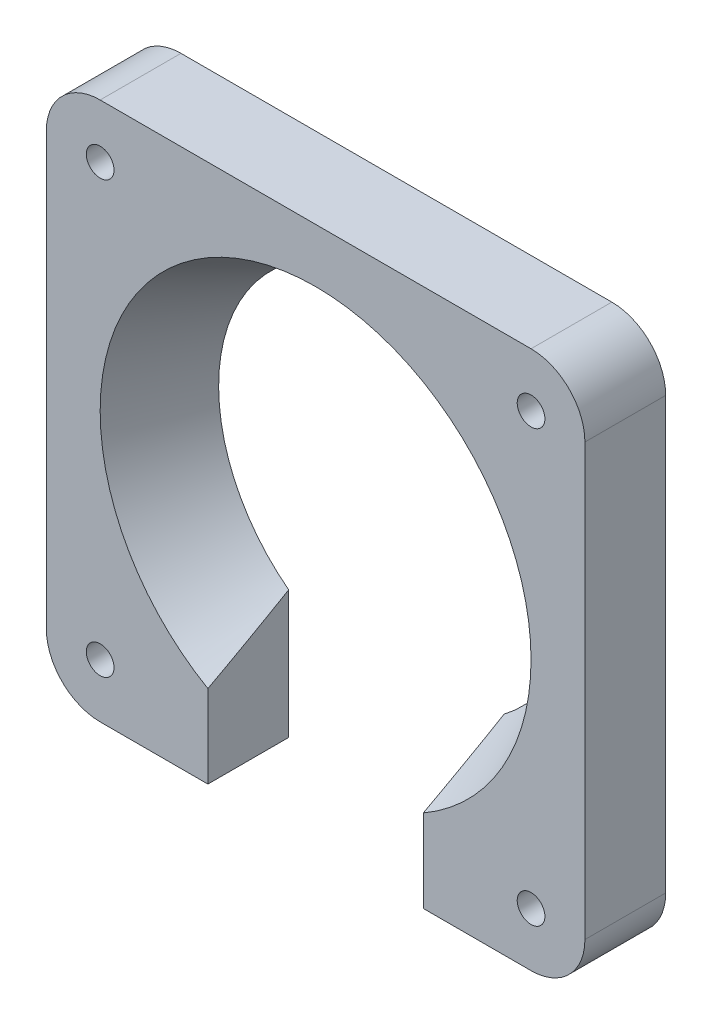
ISO-10303-21;
HEADER;
FILE_DESCRIPTION(('STEP AP214'),'2;1');
FILE_NAME('part.step','',(''),(''),'','','');
FILE_SCHEMA(('AUTOMOTIVE_DESIGN { 1 0 10303 214 1 1 1 1 }'));
ENDSEC;
DATA;
#1=APPLICATION_CONTEXT('core data for automotive mechanical design processes');
#2=APPLICATION_PROTOCOL_DEFINITION('international standard','automotive_design',2000,#1);
#3=PRODUCT_CONTEXT('',#1,'mechanical');
#4=PRODUCT('Part','Part','',(#3));
#5=PRODUCT_RELATED_PRODUCT_CATEGORY('part','',(#4));
#6=PRODUCT_DEFINITION_FORMATION('','',#4);
#7=PRODUCT_DEFINITION_CONTEXT('part definition',#1,'design');
#8=PRODUCT_DEFINITION('design','',#6,#7);
#9=PRODUCT_DEFINITION_SHAPE('','',#8);
#10=(LENGTH_UNIT() NAMED_UNIT(*) SI_UNIT(.MILLI.,.METRE.));
#11=(NAMED_UNIT(*) PLANE_ANGLE_UNIT() SI_UNIT($,.RADIAN.));
#12=(NAMED_UNIT(*) SI_UNIT($,.STERADIAN.) SOLID_ANGLE_UNIT());
#13=UNCERTAINTY_MEASURE_WITH_UNIT(LENGTH_MEASURE(1.E-05),#10,'distance_accuracy_value','');
#14=(GEOMETRIC_REPRESENTATION_CONTEXT(3) GLOBAL_UNCERTAINTY_ASSIGNED_CONTEXT((#13)) GLOBAL_UNIT_ASSIGNED_CONTEXT((#10,
#11,#12)) REPRESENTATION_CONTEXT('',''));
#15=CARTESIAN_POINT('',(0.,0.,0.));
#16=DIRECTION('',(0.,0.,1.));
#17=DIRECTION('',(1.,0.,0.));
#18=AXIS2_PLACEMENT_3D('',#15,#16,#17);
#19=CARTESIAN_POINT('',(-27.3498641304348,-38.0482336956522,9.525));
#20=DIRECTION('',(0.,1.,0.));
#21=DIRECTION('',(0.,0.,1.));
#22=AXIS2_PLACEMENT_3D('',#19,#20,#21);
#23=PLANE('',#22);
#24=DIRECTION('',(1.,0.,0.));
#25=VECTOR('',#24,1.);
#26=CARTESIAN_POINT('',(-27.3498641304348,-38.0482336956522,9.525));
#27=LINE('',#26,#25);
#28=CARTESIAN_POINT('',(-20.9998641304348,-38.0482336956522,9.525));
#29=VERTEX_POINT('',#28);
#30=CARTESIAN_POINT('',(-8.29986413043476,-38.0482336956522,9.525));
#31=VERTEX_POINT('',#30);
#32=EDGE_CURVE('E122',#29,#31,#27,.T.);
#33=ORIENTED_EDGE('',*,*,#32,.F.);
#34=DIRECTION('',(0.,0.,-1.));
#35=VECTOR('',#34,1.);
#36=CARTESIAN_POINT('',(-20.9998641304348,-38.0482336956522,9.525));
#37=LINE('',#36,#35);
#38=CARTESIAN_POINT('',(-20.9998641304348,-38.0482336956522,0.));
#39=VERTEX_POINT('',#38);
#40=EDGE_CURVE('E374',#29,#39,#37,.T.);
#41=ORIENTED_EDGE('',*,*,#40,.T.);
#42=DIRECTION('',(1.,0.,0.));
#43=VECTOR('',#42,1.);
#44=CARTESIAN_POINT('',(-27.3498641304348,-38.0482336956522,0.));
#45=LINE('',#44,#43);
#46=CARTESIAN_POINT('',(-8.29986413043476,-38.0482336956522,0.));
#47=VERTEX_POINT('',#46);
#48=EDGE_CURVE('E149',#39,#47,#45,.T.);
#49=ORIENTED_EDGE('',*,*,#48,.T.);
#50=DIRECTION('',(0.,0.,1.));
#51=VECTOR('',#50,1.);
#52=CARTESIAN_POINT('',(-8.29986413043476,-38.0482336956522,-38.390523041433));
#53=LINE('',#52,#51);
#54=EDGE_CURVE('E141',#47,#31,#53,.T.);
#55=ORIENTED_EDGE('',*,*,#54,.T.);
#56=EDGE_LOOP('',(#33,#41,#49,#55));
#57=FACE_BOUND('',#56,.T.);
#58=ADVANCED_FACE('F33',(#57),#23,.F.);
#59=CARTESIAN_POINT('',(-27.3498641304348,25.4517663043478,9.525));
#60=DIRECTION('',(1.,0.,0.));
#61=DIRECTION('',(0.,1.,0.));
#62=AXIS2_PLACEMENT_3D('',#59,#60,#61);
#63=PLANE('',#62);
#64=DIRECTION('',(0.,-1.,0.));
#65=VECTOR('',#64,1.);
#66=CARTESIAN_POINT('',(-27.3498641304348,25.4517663043478,9.525));
#67=LINE('',#66,#65);
#68=CARTESIAN_POINT('',(-27.3498641304348,19.1017663043478,9.525));
#69=VERTEX_POINT('',#68);
#70=CARTESIAN_POINT('',(-27.3498641304348,-31.6982336956522,9.525));
#71=VERTEX_POINT('',#70);
#72=EDGE_CURVE('E160',#69,#71,#67,.T.);
#73=ORIENTED_EDGE('',*,*,#72,.F.);
#74=DIRECTION('',(0.,0.,-1.));
#75=VECTOR('',#74,1.);
#76=CARTESIAN_POINT('',(-27.3498641304348,19.1017663043478,9.525));
#77=LINE('',#76,#75);
#78=CARTESIAN_POINT('',(-27.3498641304348,19.1017663043478,0.));
#79=VERTEX_POINT('',#78);
#80=EDGE_CURVE('E399',#69,#79,#77,.T.);
#81=ORIENTED_EDGE('',*,*,#80,.T.);
#82=DIRECTION('',(0.,-1.,0.));
#83=VECTOR('',#82,1.);
#84=CARTESIAN_POINT('',(-27.3498641304348,25.4517663043478,0.));
#85=LINE('',#84,#83);
#86=CARTESIAN_POINT('',(-27.3498641304348,-31.6982336956522,0.));
#87=VERTEX_POINT('',#86);
#88=EDGE_CURVE('E168',#79,#87,#85,.T.);
#89=ORIENTED_EDGE('',*,*,#88,.T.);
#90=DIRECTION('',(0.,0.,-1.));
#91=VECTOR('',#90,1.);
#92=CARTESIAN_POINT('',(-27.3498641304348,-31.6982336956522,9.525));
#93=LINE('',#92,#91);
#94=EDGE_CURVE('E365',#87,#71,#93,.F.);
#95=ORIENTED_EDGE('',*,*,#94,.T.);
#96=EDGE_LOOP('',(#73,#81,#89,#95));
#97=FACE_BOUND('',#96,.T.);
#98=ADVANCED_FACE('F219',(#97),#63,.F.);
#99=CARTESIAN_POINT('',(17.1001358695652,-38.0482336956522,0.));
#100=VERTEX_POINT('',#99);
#101=CARTESIAN_POINT('',(29.8001358695652,-38.0482336956522,0.));
#102=VERTEX_POINT('',#101);
#103=EDGE_CURVE('E171',#100,#102,#45,.T.);
#104=ORIENTED_EDGE('',*,*,#103,.T.);
#105=DIRECTION('',(0.,0.,-1.));
#106=VECTOR('',#105,1.);
#107=CARTESIAN_POINT('',(29.8001358695652,-38.0482336956522,9.525));
#108=LINE('',#107,#106);
#109=CARTESIAN_POINT('',(29.8001358695652,-38.0482336956522,9.525));
#110=VERTEX_POINT('',#109);
#111=EDGE_CURVE('E41',#102,#110,#108,.F.);
#112=ORIENTED_EDGE('',*,*,#111,.T.);
#113=CARTESIAN_POINT('',(17.1001358695652,-38.0482336956522,9.525));
#114=VERTEX_POINT('',#113);
#115=EDGE_CURVE('E136',#114,#110,#27,.T.);
#116=ORIENTED_EDGE('',*,*,#115,.F.);
#117=DIRECTION('',(0.,0.,1.));
#118=VECTOR('',#117,1.);
#119=CARTESIAN_POINT('',(17.1001358695652,-38.0482336956522,-38.390523041433));
#120=LINE('',#119,#118);
#121=EDGE_CURVE('E150',#100,#114,#120,.T.);
#122=ORIENTED_EDGE('',*,*,#121,.F.);
#123=EDGE_LOOP('',(#104,#112,#116,#122));
#124=FACE_BOUND('',#123,.T.);
#125=ADVANCED_FACE('F215',(#124),#23,.F.);
#126=CARTESIAN_POINT('',(36.1501358695652,25.4517663043478,9.525));
#127=DIRECTION('',(-1.,0.,0.));
#128=DIRECTION('',(0.,-1.,0.));
#129=AXIS2_PLACEMENT_3D('',#126,#127,#128);
#130=PLANE('',#129);
#131=DIRECTION('',(0.,1.,0.));
#132=VECTOR('',#131,1.);
#133=CARTESIAN_POINT('',(36.1501358695652,25.4517663043478,9.525));
#134=LINE('',#133,#132);
#135=CARTESIAN_POINT('',(36.1501358695652,-31.6982336956522,9.525));
#136=VERTEX_POINT('',#135);
#137=CARTESIAN_POINT('',(36.1501358695652,19.1017663043478,9.525));
#138=VERTEX_POINT('',#137);
#139=EDGE_CURVE('E135',#136,#138,#134,.T.);
#140=ORIENTED_EDGE('',*,*,#139,.F.);
#141=DIRECTION('',(0.,0.,-1.));
#142=VECTOR('',#141,1.);
#143=CARTESIAN_POINT('',(36.1501358695652,-31.6982336956522,9.525));
#144=LINE('',#143,#142);
#145=CARTESIAN_POINT('',(36.1501358695652,-31.6982336956522,0.));
#146=VERTEX_POINT('',#145);
#147=EDGE_CURVE('E373',#136,#146,#144,.T.);
#148=ORIENTED_EDGE('',*,*,#147,.T.);
#149=DIRECTION('',(0.,1.,0.));
#150=VECTOR('',#149,1.);
#151=CARTESIAN_POINT('',(36.1501358695652,25.4517663043478,0.));
#152=LINE('',#151,#150);
#153=CARTESIAN_POINT('',(36.1501358695652,19.1017663043478,0.));
#154=VERTEX_POINT('',#153);
#155=EDGE_CURVE('E173',#146,#154,#152,.T.);
#156=ORIENTED_EDGE('',*,*,#155,.T.);
#157=DIRECTION('',(0.,0.,-1.));
#158=VECTOR('',#157,1.);
#159=CARTESIAN_POINT('',(36.1501358695652,19.1017663043478,9.525));
#160=LINE('',#159,#158);
#161=EDGE_CURVE('E377',#154,#138,#160,.F.);
#162=ORIENTED_EDGE('',*,*,#161,.T.);
#163=EDGE_LOOP('',(#140,#148,#156,#162));
#164=FACE_BOUND('',#163,.T.);
#165=ADVANCED_FACE('F211',(#164),#130,.F.);
#166=CARTESIAN_POINT('',(-27.3498641304348,25.4517663043478,9.525));
#167=DIRECTION('',(0.,-1.,0.));
#168=DIRECTION('',(0.,0.,-1.));
#169=AXIS2_PLACEMENT_3D('',#166,#167,#168);
#170=PLANE('',#169);
#171=DIRECTION('',(-1.,0.,0.));
#172=VECTOR('',#171,1.);
#173=CARTESIAN_POINT('',(-27.3498641304348,25.4517663043478,0.));
#174=LINE('',#173,#172);
#175=CARTESIAN_POINT('',(29.8001358695652,25.4517663043478,0.));
#176=VERTEX_POINT('',#175);
#177=CARTESIAN_POINT('',(-20.9998641304348,25.4517663043478,0.));
#178=VERTEX_POINT('',#177);
#179=EDGE_CURVE('E161',#176,#178,#174,.T.);
#180=ORIENTED_EDGE('',*,*,#179,.T.);
#181=DIRECTION('',(0.,0.,-1.));
#182=VECTOR('',#181,1.);
#183=CARTESIAN_POINT('',(-20.9998641304348,25.4517663043478,9.525));
#184=LINE('',#183,#182);
#185=CARTESIAN_POINT('',(-20.9998641304348,25.4517663043478,9.525));
#186=VERTEX_POINT('',#185);
#187=EDGE_CURVE('E387',#178,#186,#184,.F.);
#188=ORIENTED_EDGE('',*,*,#187,.T.);
#189=DIRECTION('',(-1.,0.,0.));
#190=VECTOR('',#189,1.);
#191=CARTESIAN_POINT('',(-27.3498641304348,25.4517663043478,9.525));
#192=LINE('',#191,#190);
#193=CARTESIAN_POINT('',(29.8001358695652,25.4517663043478,9.525));
#194=VERTEX_POINT('',#193);
#195=EDGE_CURVE('E164',#194,#186,#192,.T.);
#196=ORIENTED_EDGE('',*,*,#195,.F.);
#197=DIRECTION('',(0.,0.,-1.));
#198=VECTOR('',#197,1.);
#199=CARTESIAN_POINT('',(29.8001358695652,25.4517663043478,9.525));
#200=LINE('',#199,#198);
#201=EDGE_CURVE('E389',#194,#176,#200,.T.);
#202=ORIENTED_EDGE('',*,*,#201,.T.);
#203=EDGE_LOOP('',(#180,#188,#196,#202));
#204=FACE_BOUND('',#203,.T.);
#205=ADVANCED_FACE('F204',(#204),#170,.F.);
#206=CARTESIAN_POINT('',(0.,0.,9.525));
#207=DIRECTION('',(0.,0.,1.));
#208=DIRECTION('',(1.,0.,0.));
#209=AXIS2_PLACEMENT_3D('',#206,#207,#208);
#210=PLANE('',#209);
#211=CARTESIAN_POINT('',(-20.9998641304342,-31.6982336956522,9.525));
#212=DIRECTION('',(0.,0.,1.));
#213=DIRECTION('',(1.,0.,0.));
#214=AXIS2_PLACEMENT_3D('',#211,#212,#213);
#215=CIRCLE('',#214,1.63195);
#216=CARTESIAN_POINT('',(-19.3679141304342,-31.6982336956522,9.525));
#217=VERTEX_POINT('',#216);
#218=EDGE_CURVE('E342',#217,#217,#215,.T.);
#219=ORIENTED_EDGE('',*,*,#218,.F.);
#220=EDGE_LOOP('',(#219));
#221=FACE_BOUND('',#220,.T.);
#222=CARTESIAN_POINT('',(29.8001358695658,-31.6982336956522,9.525));
#223=DIRECTION('',(0.,0.,1.));
#224=DIRECTION('',(1.,0.,0.));
#225=AXIS2_PLACEMENT_3D('',#222,#223,#224);
#226=CIRCLE('',#225,1.63195);
#227=CARTESIAN_POINT('',(31.4320858695658,-31.6982336956522,9.525));
#228=VERTEX_POINT('',#227);
#229=EDGE_CURVE('E344',#228,#228,#226,.T.);
#230=ORIENTED_EDGE('',*,*,#229,.F.);
#231=EDGE_LOOP('',(#230));
#232=FACE_BOUND('',#231,.T.);
#233=CARTESIAN_POINT('',(29.8001358695652,19.1017663043478,9.525));
#234=DIRECTION('',(0.,0.,1.));
#235=DIRECTION('',(1.,0.,0.));
#236=AXIS2_PLACEMENT_3D('',#233,#234,#235);
#237=CIRCLE('',#236,1.63195);
#238=CARTESIAN_POINT('',(31.4320858695652,19.1017663043478,9.525));
#239=VERTEX_POINT('',#238);
#240=EDGE_CURVE('E352',#239,#239,#237,.T.);
#241=ORIENTED_EDGE('',*,*,#240,.F.);
#242=EDGE_LOOP('',(#241));
#243=FACE_BOUND('',#242,.T.);
#244=CARTESIAN_POINT('',(-20.9998641304348,19.1017663043478,9.525));
#245=DIRECTION('',(0.,0.,1.));
#246=DIRECTION('',(1.,0.,0.));
#247=AXIS2_PLACEMENT_3D('',#244,#245,#246);
#248=CIRCLE('',#247,1.63195);
#249=CARTESIAN_POINT('',(-19.3679141304348,19.1017663043478,9.525));
#250=VERTEX_POINT('',#249);
#251=EDGE_CURVE('E358',#250,#250,#248,.T.);
#252=ORIENTED_EDGE('',*,*,#251,.F.);
#253=EDGE_LOOP('',(#252));
#254=FACE_BOUND('',#253,.T.);
#255=ORIENTED_EDGE('',*,*,#115,.T.);
#256=CARTESIAN_POINT('',(29.8001358695652,-31.6982336956522,9.525));
#257=DIRECTION('',(0.,0.,1.));
#258=DIRECTION('',(1.,0.,0.));
#259=AXIS2_PLACEMENT_3D('',#256,#257,#258);
#260=CIRCLE('',#259,6.35);
#261=EDGE_CURVE('E11',#110,#136,#260,.T.);
#262=ORIENTED_EDGE('',*,*,#261,.T.);
#263=ORIENTED_EDGE('',*,*,#139,.T.);
#264=CARTESIAN_POINT('',(29.8001358695652,19.1017663043478,9.525));
#265=DIRECTION('',(0.,0.,1.));
#266=DIRECTION('',(1.,0.,0.));
#267=AXIS2_PLACEMENT_3D('',#264,#265,#266);
#268=CIRCLE('',#267,6.35);
#269=EDGE_CURVE('E384',#138,#194,#268,.T.);
#270=ORIENTED_EDGE('',*,*,#269,.T.);
#271=ORIENTED_EDGE('',*,*,#195,.T.);
#272=CARTESIAN_POINT('',(-20.9998641304348,19.1017663043478,9.525));
#273=DIRECTION('',(0.,0.,1.));
#274=DIRECTION('',(1.,0.,0.));
#275=AXIS2_PLACEMENT_3D('',#272,#273,#274);
#276=CIRCLE('',#275,6.35);
#277=EDGE_CURVE('E382',#186,#69,#276,.T.);
#278=ORIENTED_EDGE('',*,*,#277,.T.);
#279=ORIENTED_EDGE('',*,*,#72,.T.);
#280=CARTESIAN_POINT('',(-20.9998641304348,-31.6982336956522,9.525));
#281=DIRECTION('',(0.,0.,1.));
#282=DIRECTION('',(1.,0.,0.));
#283=AXIS2_PLACEMENT_3D('',#280,#281,#282);
#284=CIRCLE('',#283,6.35);
#285=EDGE_CURVE('E130',#71,#29,#284,.T.);
#286=ORIENTED_EDGE('',*,*,#285,.T.);
#287=ORIENTED_EDGE('',*,*,#32,.T.);
#288=DIRECTION('',(0.,-1.,0.));
#289=VECTOR('',#288,1.);
#290=CARTESIAN_POINT('',(-8.29986413043476,-38.0482336956522,9.525));
#291=LINE('',#290,#289);
#292=CARTESIAN_POINT('',(-8.29986413043476,-28.2952789517769,9.525));
#293=VERTEX_POINT('',#292);
#294=EDGE_CURVE('E126',#293,#31,#291,.T.);
#295=ORIENTED_EDGE('',*,*,#294,.F.);
#296=CARTESIAN_POINT('',(4.40013586956524,-6.29823369565218,9.525));
#297=DIRECTION('',(0.,0.,1.));
#298=DIRECTION('',(1.,0.,0.));
#299=AXIS2_PLACEMENT_3D('',#296,#297,#298);
#300=CIRCLE('',#299,25.4);
#301=CARTESIAN_POINT('',(17.1001358695652,-28.2952789517769,9.525));
#302=VERTEX_POINT('',#301);
#303=EDGE_CURVE('E156',#302,#293,#300,.T.);
#304=ORIENTED_EDGE('',*,*,#303,.F.);
#305=DIRECTION('',(0.,1.,0.));
#306=VECTOR('',#305,1.);
#307=CARTESIAN_POINT('',(17.1001358695652,-38.0482336956522,9.525));
#308=LINE('',#307,#306);
#309=EDGE_CURVE('E145',#114,#302,#308,.T.);
#310=ORIENTED_EDGE('',*,*,#309,.F.);
#311=EDGE_LOOP('',(#255,#262,#263,#270,#271,#278,#279,#286,#287,#295,#304,#310));
#312=FACE_BOUND('',#311,.T.);
#313=ADVANCED_FACE('F124',(#221,#232,#243,#254,#312),#210,.T.);
#314=CARTESIAN_POINT('',(0.,0.,0.));
#315=DIRECTION('',(0.,0.,1.));
#316=DIRECTION('',(1.,0.,0.));
#317=AXIS2_PLACEMENT_3D('',#314,#315,#316);
#318=PLANE('',#317);
#319=CARTESIAN_POINT('',(-20.9998641304342,-31.6982336956522,0.));
#320=DIRECTION('',(0.,0.,1.));
#321=DIRECTION('',(1.,0.,0.));
#322=AXIS2_PLACEMENT_3D('',#319,#320,#321);
#323=CIRCLE('',#322,1.63195);
#324=CARTESIAN_POINT('',(-19.3679141304342,-31.6982336956522,0.));
#325=VERTEX_POINT('',#324);
#326=EDGE_CURVE('E339',#325,#325,#323,.F.);
#327=ORIENTED_EDGE('',*,*,#326,.F.);
#328=EDGE_LOOP('',(#327));
#329=FACE_BOUND('',#328,.T.);
#330=CARTESIAN_POINT('',(29.8001358695658,-31.6982336956522,0.));
#331=DIRECTION('',(0.,0.,1.));
#332=DIRECTION('',(1.,0.,0.));
#333=AXIS2_PLACEMENT_3D('',#330,#331,#332);
#334=CIRCLE('',#333,1.63195);
#335=CARTESIAN_POINT('',(31.4320858695658,-31.6982336956522,0.));
#336=VERTEX_POINT('',#335);
#337=EDGE_CURVE('E349',#336,#336,#334,.F.);
#338=ORIENTED_EDGE('',*,*,#337,.F.);
#339=EDGE_LOOP('',(#338));
#340=FACE_BOUND('',#339,.T.);
#341=CARTESIAN_POINT('',(29.8001358695652,19.1017663043478,0.));
#342=DIRECTION('',(0.,0.,1.));
#343=DIRECTION('',(1.,0.,0.));
#344=AXIS2_PLACEMENT_3D('',#341,#342,#343);
#345=CIRCLE('',#344,1.63195);
#346=CARTESIAN_POINT('',(31.4320858695652,19.1017663043478,0.));
#347=VERTEX_POINT('',#346);
#348=EDGE_CURVE('E355',#347,#347,#345,.F.);
#349=ORIENTED_EDGE('',*,*,#348,.F.);
#350=EDGE_LOOP('',(#349));
#351=FACE_BOUND('',#350,.T.);
#352=CARTESIAN_POINT('',(-20.9998641304348,19.1017663043478,0.));
#353=DIRECTION('',(0.,0.,1.));
#354=DIRECTION('',(1.,0.,0.));
#355=AXIS2_PLACEMENT_3D('',#352,#353,#354);
#356=CIRCLE('',#355,1.63195);
#357=CARTESIAN_POINT('',(-19.3679141304348,19.1017663043478,0.));
#358=VERTEX_POINT('',#357);
#359=EDGE_CURVE('E146',#358,#358,#356,.F.);
#360=ORIENTED_EDGE('',*,*,#359,.F.);
#361=EDGE_LOOP('',(#360));
#362=FACE_BOUND('',#361,.T.);
#363=ORIENTED_EDGE('',*,*,#155,.F.);
#364=CARTESIAN_POINT('',(29.8001358695652,-31.6982336956522,0.));
#365=DIRECTION('',(0.,0.,1.));
#366=DIRECTION('',(1.,0.,0.));
#367=AXIS2_PLACEMENT_3D('',#364,#365,#366);
#368=CIRCLE('',#367,6.35);
#369=EDGE_CURVE('E55',#146,#102,#368,.F.);
#370=ORIENTED_EDGE('',*,*,#369,.T.);
#371=ORIENTED_EDGE('',*,*,#103,.F.);
#372=DIRECTION('',(0.,-1.,0.));
#373=VECTOR('',#372,1.);
#374=CARTESIAN_POINT('',(17.1001358695652,-38.0482336956522,0.));
#375=LINE('',#374,#373);
#376=CARTESIAN_POINT('',(17.1001358695652,-22.9705265880053,0.));
#377=VERTEX_POINT('',#376);
#378=EDGE_CURVE('E152',#377,#100,#375,.T.);
#379=ORIENTED_EDGE('',*,*,#378,.F.);
#380=CARTESIAN_POINT('',(4.40013586956524,-6.29823369565218,0.));
#381=DIRECTION('',(0.,0.,1.));
#382=DIRECTION('',(1.,0.,0.));
#383=AXIS2_PLACEMENT_3D('',#380,#381,#382);
#384=CIRCLE('',#383,20.9584195560736);
#385=CARTESIAN_POINT('',(-8.29986413043476,-22.9705265880053,0.));
#386=VERTEX_POINT('',#385);
#387=EDGE_CURVE('E158',#377,#386,#384,.T.);
#388=ORIENTED_EDGE('',*,*,#387,.T.);
#389=DIRECTION('',(0.,1.,0.));
#390=VECTOR('',#389,1.);
#391=CARTESIAN_POINT('',(-8.29986413043476,-38.0482336956522,0.));
#392=LINE('',#391,#390);
#393=EDGE_CURVE('E159',#47,#386,#392,.T.);
#394=ORIENTED_EDGE('',*,*,#393,.F.);
#395=ORIENTED_EDGE('',*,*,#48,.F.);
#396=CARTESIAN_POINT('',(-20.9998641304348,-31.6982336956522,0.));
#397=DIRECTION('',(0.,0.,1.));
#398=DIRECTION('',(1.,0.,0.));
#399=AXIS2_PLACEMENT_3D('',#396,#397,#398);
#400=CIRCLE('',#399,6.35);
#401=EDGE_CURVE('E397',#39,#87,#400,.F.);
#402=ORIENTED_EDGE('',*,*,#401,.T.);
#403=ORIENTED_EDGE('',*,*,#88,.F.);
#404=CARTESIAN_POINT('',(-20.9998641304348,19.1017663043478,0.));
#405=DIRECTION('',(0.,0.,1.));
#406=DIRECTION('',(1.,0.,0.));
#407=AXIS2_PLACEMENT_3D('',#404,#405,#406);
#408=CIRCLE('',#407,6.35);
#409=EDGE_CURVE('E392',#79,#178,#408,.F.);
#410=ORIENTED_EDGE('',*,*,#409,.T.);
#411=ORIENTED_EDGE('',*,*,#179,.F.);
#412=CARTESIAN_POINT('',(29.8001358695652,19.1017663043478,0.));
#413=DIRECTION('',(0.,0.,1.));
#414=DIRECTION('',(1.,0.,0.));
#415=AXIS2_PLACEMENT_3D('',#412,#413,#414);
#416=CIRCLE('',#415,6.35);
#417=EDGE_CURVE('E394',#176,#154,#416,.F.);
#418=ORIENTED_EDGE('',*,*,#417,.T.);
#419=EDGE_LOOP('',(#363,#370,#371,#379,#388,#394,#395,#402,#403,#410,#411,#418));
#420=FACE_BOUND('',#419,.T.);
#421=ADVANCED_FACE('F198',(#329,#340,#351,#362,#420),#318,.F.);
#422=CARTESIAN_POINT('',(4.40013586956524,-6.29823369565218,9.525));
#423=DIRECTION('',(0.,0.,1.));
#424=DIRECTION('',(1.,0.,0.));
#425=AXIS2_PLACEMENT_3D('',#422,#423,#424);
#426=CONICAL_SURFACE('',#425,25.4,0.436332312998583);
#427=ORIENTED_EDGE('',*,*,#303,.T.);
#428=CARTESIAN_POINT('',(-8.29986413043476,-43.223035633129,38.7928101524576));
#429=CARTESIAN_POINT('',(-8.29986413043476,-42.5873699572847,37.5037876512553));
#430=CARTESIAN_POINT('',(-8.29986413043476,-41.9503459683332,36.2154331346811));
#431=CARTESIAN_POINT('',(-8.29986413043476,-40.673023977189,33.640339422663));
#432=CARTESIAN_POINT('',(-8.29986413043476,-40.0327259566904,32.3536002363008));
#433=CARTESIAN_POINT('',(-8.29986413043476,-38.7481937130702,29.7818069234031));
#434=CARTESIAN_POINT('',(-8.29986413043476,-38.1039588235012,28.4967531295616));
#435=CARTESIAN_POINT('',(-8.29986413043476,-36.8109321479781,25.9289422349335));
#436=CARTESIAN_POINT('',(-8.29986413043476,-36.1621403711872,24.6461851295351));
#437=CARTESIAN_POINT('',(-8.29986413043476,-34.8524103967518,22.0703520935095));
#438=CARTESIAN_POINT('',(-8.29986413043476,-34.191415836118,20.777304802498));
#439=CARTESIAN_POINT('',(-8.29986413043476,-32.8625911584359,18.1947276575962));
#440=CARTESIAN_POINT('',(-8.29986413043476,-32.194761057699,16.9051977953218));
#441=CARTESIAN_POINT('',(-8.29986413043476,-30.8506551484377,14.330652020218));
#442=CARTESIAN_POINT('',(-8.29986413043476,-30.1743799025163,13.0456358139263));
#443=CARTESIAN_POINT('',(-8.29986413043476,-28.8111112466367,10.481303564155));
#444=CARTESIAN_POINT('',(-8.29986413043476,-28.1241179478911,9.2019874617069));
#445=CARTESIAN_POINT('',(-8.29986413043476,-27.0841166303343,7.29038808813477));
#446=CARTESIAN_POINT('',(-8.29986413043476,-26.7363350028036,6.65526060998588));
#447=CARTESIAN_POINT('',(-8.29986413043476,-26.0367782637432,5.38720925652358));
#448=CARTESIAN_POINT('',(-8.29986413043476,-25.6850031645022,4.75428537443714));
#449=CARTESIAN_POINT('',(-8.29986413043476,-24.9768173781704,3.49099675293552));
#450=CARTESIAN_POINT('',(-8.29986413043476,-24.6204064831427,2.8606321299907));
#451=CARTESIAN_POINT('',(-8.29986413043476,-23.9021884825069,1.60298350643198));
#452=CARTESIAN_POINT('',(-8.29986413043476,-23.5403813920478,0.975699497176388));
#453=CARTESIAN_POINT('',(-8.29986413043476,-22.8117648211256,-0.272823572855804));
#454=CARTESIAN_POINT('',(-8.29986413043476,-22.4449790646776,-0.894076459490905));
#455=CARTESIAN_POINT('',(-8.29986413043476,-21.7038813954196,-2.13207412212091));
#456=CARTESIAN_POINT('',(-8.29986413043476,-21.3295695733027,-2.7488189523183));
#457=CARTESIAN_POINT('',(-8.29986413043476,-20.5718384729146,-3.97674005353686));
#458=CARTESIAN_POINT('',(-8.29986413043476,-20.1884187943528,-4.58791607816947));
#459=CARTESIAN_POINT('',(-8.29986413043476,-19.41045408442,-5.80312680308748));
#460=CARTESIAN_POINT('',(-8.29986413043476,-19.0159094982812,-6.40716178779655));
#461=CARTESIAN_POINT('',(-8.29986413043476,-18.2117289980107,-7.60779556333008));
#462=CARTESIAN_POINT('',(-8.29986413043476,-17.8020512569043,-8.20436651888663));
#463=CARTESIAN_POINT('',(-8.29986413043476,-17.1742644181978,-9.08964355194574));
#464=CARTESIAN_POINT('',(-8.29986413043476,-16.9628303381482,-9.38308650771256));
#465=CARTESIAN_POINT('',(-8.29986413043476,-16.5348787185661,-9.96623708039018));
#466=CARTESIAN_POINT('',(-8.29986413043476,-16.3183613276268,-10.255944806105));
#467=CARTESIAN_POINT('',(-8.29986413043476,-15.8787812997713,-10.8318694610529));
#468=CARTESIAN_POINT('',(-8.29986413043476,-15.6556994944775,-11.1180717927876));
#469=CARTESIAN_POINT('',(-8.29986413043476,-15.2027936332296,-11.6850531643866));
#470=CARTESIAN_POINT('',(-8.29986413043476,-14.9729702900664,-11.9658327724331));
#471=CARTESIAN_POINT('',(-8.29986413043476,-14.5051564414551,-12.5211585591793));
#472=CARTESIAN_POINT('',(-8.29986413043476,-14.2671557838587,-12.7956962304671));
#473=CARTESIAN_POINT('',(-8.29986413043476,-13.9032052794145,-13.2013498511692));
#474=CARTESIAN_POINT('',(-8.29986413043476,-13.7807067587313,-13.3355666367799));
#475=CARTESIAN_POINT('',(-8.29986413043476,-13.5331925061015,-13.601675706143));
#476=CARTESIAN_POINT('',(-8.29986413043476,-13.4081765898583,-13.7335678183726));
#477=CARTESIAN_POINT('',(-8.29986413043476,-13.2818039329693,-13.8641600903619));
#478=B_SPLINE_CURVE_WITH_KNOTS('',3,(#428,#429,#430,#431,#432,#433,#434,#435,#436,#437,#438,
#439,#440,#441,#442,#443,#444,#445,#446,#447,#448,#449,#450,#451,#452,#453,#454,#455,#456,#457,
#458,#459,#460,#461,#462,#463,#464,#465,#466,#467,#468,#469,#470,#471,#472,#473,#474,#475,#476,
#477),.UNSPECIFIED.,.F.,.F.,(4,2,2,2,2,2,2,2,2,2,2,2,2,2,2,2,2,2,2,2,2,2,2,2,4),(0.,
4.31171232926855,8.62344879280538,12.9359365828072,17.2484157036121,21.6049998254846,
25.9615735538032,30.3178585857216,34.6740984459989,36.8464246916182,39.0187442544247,
41.191161594274,43.3635728366179,45.527872153637,47.6921454053176,49.8565139535127,
52.0207960036929,54.1915885758715,55.276587842217,56.3615554317359,57.4500879303468,
58.5385057490448,59.6283274769779,60.1734411726694,60.718594921872),.UNSPECIFIED.);
#479=EDGE_CURVE('E144',#293,#386,#478,.T.);
#480=ORIENTED_EDGE('',*,*,#479,.T.);
#481=ORIENTED_EDGE('',*,*,#387,.F.);
#482=CARTESIAN_POINT('',(17.1001358695652,-43.223035633129,38.7928101524576));
#483=CARTESIAN_POINT('',(17.1001358695652,-42.5873699572847,37.5037876512553));
#484=CARTESIAN_POINT('',(17.1001358695652,-41.9503459683332,36.2154331346811));
#485=CARTESIAN_POINT('',(17.1001358695652,-40.673023977189,33.640339422663));
#486=CARTESIAN_POINT('',(17.1001358695652,-40.0327259566904,32.3536002363008));
#487=CARTESIAN_POINT('',(17.1001358695652,-38.7481937130702,29.7818069234031));
#488=CARTESIAN_POINT('',(17.1001358695652,-38.1039588235012,28.4967531295616));
#489=CARTESIAN_POINT('',(17.1001358695652,-36.8109321479781,25.9289422349334));
#490=CARTESIAN_POINT('',(17.1001358695652,-36.1621403711872,24.6461851295351));
#491=CARTESIAN_POINT('',(17.1001358695652,-34.8524103967517,22.0703520935095));
#492=CARTESIAN_POINT('',(17.1001358695652,-34.191415836118,20.7773048024979));
#493=CARTESIAN_POINT('',(17.1001358695652,-32.8625911584359,18.1947276575962));
#494=CARTESIAN_POINT('',(17.1001358695652,-32.194761057699,16.9051977953218));
#495=CARTESIAN_POINT('',(17.1001358695652,-30.8506551484377,14.330652020218));
#496=CARTESIAN_POINT('',(17.1001358695652,-30.1743799025162,13.0456358139263));
#497=CARTESIAN_POINT('',(17.1001358695652,-28.8111112466367,10.481303564155));
#498=CARTESIAN_POINT('',(17.1001358695652,-28.1241179478911,9.20198746170689));
#499=CARTESIAN_POINT('',(17.1001358695652,-27.0841166303343,7.29038808813476));
#500=CARTESIAN_POINT('',(17.1001358695652,-26.7363350028036,6.65526060998588));
#501=CARTESIAN_POINT('',(17.1001358695652,-26.0367782637432,5.38720925652358));
#502=CARTESIAN_POINT('',(17.1001358695652,-25.6850031645022,4.75428537443714));
#503=CARTESIAN_POINT('',(17.1001358695652,-24.9768173781705,3.49099675293551));
#504=CARTESIAN_POINT('',(17.1001358695652,-24.6204064831427,2.8606321299907));
#505=CARTESIAN_POINT('',(17.1001358695652,-23.9021884825069,1.60298350643197));
#506=CARTESIAN_POINT('',(17.1001358695652,-23.5403813920478,0.975699497176384));
#507=CARTESIAN_POINT('',(17.1001358695652,-22.8117648211256,-0.27282357285581));
#508=CARTESIAN_POINT('',(17.1001358695652,-22.4449790646776,-0.894076459490912));
#509=CARTESIAN_POINT('',(17.1001358695652,-21.7038813954196,-2.13207412212091));
#510=CARTESIAN_POINT('',(17.1001358695652,-21.3295695733027,-2.7488189523183));
#511=CARTESIAN_POINT('',(17.1001358695652,-20.5718384729146,-3.97674005353687));
#512=CARTESIAN_POINT('',(17.1001358695652,-20.1884187943528,-4.58791607816948));
#513=CARTESIAN_POINT('',(17.1001358695652,-19.41045408442,-5.80312680308749));
#514=CARTESIAN_POINT('',(17.1001358695652,-19.0159094982812,-6.40716178779655));
#515=CARTESIAN_POINT('',(17.1001358695652,-18.2117289980107,-7.60779556333009));
#516=CARTESIAN_POINT('',(17.1001358695652,-17.8020512569043,-8.20436651888664));
#517=CARTESIAN_POINT('',(17.1001358695652,-17.1742644181978,-9.08964355194575));
#518=CARTESIAN_POINT('',(17.1001358695652,-16.9628303381482,-9.38308650771257));
#519=CARTESIAN_POINT('',(17.1001358695652,-16.5348787185661,-9.96623708039019));
#520=CARTESIAN_POINT('',(17.1001358695652,-16.3183613276268,-10.255944806105));
#521=CARTESIAN_POINT('',(17.1001358695652,-15.8787812997713,-10.8318694610529));
#522=CARTESIAN_POINT('',(17.1001358695652,-15.6556994944775,-11.1180717927876));
#523=CARTESIAN_POINT('',(17.1001358695652,-15.2027936332296,-11.6850531643866));
#524=CARTESIAN_POINT('',(17.1001358695652,-14.9729702900664,-11.9658327724331));
#525=CARTESIAN_POINT('',(17.1001358695652,-14.5051564414551,-12.5211585591793));
#526=CARTESIAN_POINT('',(17.1001358695652,-14.2671557838587,-12.7956962304671));
#527=CARTESIAN_POINT('',(17.1001358695652,-13.9032052794145,-13.2013498511692));
#528=CARTESIAN_POINT('',(17.1001358695652,-13.7807067587313,-13.3355666367799));
#529=CARTESIAN_POINT('',(17.1001358695652,-13.5331925061015,-13.601675706143));
#530=CARTESIAN_POINT('',(17.1001358695652,-13.4081765898583,-13.7335678183726));
#531=CARTESIAN_POINT('',(17.1001358695652,-13.2818039329693,-13.8641600903619));
#532=B_SPLINE_CURVE_WITH_KNOTS('',3,(#482,#483,#484,#485,#486,#487,#488,#489,#490,#491,#492,
#493,#494,#495,#496,#497,#498,#499,#500,#501,#502,#503,#504,#505,#506,#507,#508,#509,#510,#511,
#512,#513,#514,#515,#516,#517,#518,#519,#520,#521,#522,#523,#524,#525,#526,#527,#528,#529,#530,
#531),.UNSPECIFIED.,.F.,.F.,(4,2,2,2,2,2,2,2,2,2,2,2,2,2,2,2,2,2,2,2,2,2,2,2,4),(0.,
4.31171232926855,8.62344879280539,12.9359365828072,17.2484157036121,21.6049998254846,
25.9615735538032,30.3178585857216,34.6740984459989,36.8464246916182,39.0187442544247,
41.191161594274,43.3635728366179,45.527872153637,47.6921454053176,49.8565139535127,
52.0207960036929,54.1915885758715,55.276587842217,56.3615554317359,57.4500879303468,
58.5385057490448,59.6283274769779,60.1734411726694,60.718594921872),.UNSPECIFIED.);
#533=EDGE_CURVE('E167',#377,#302,#532,.F.);
#534=ORIENTED_EDGE('',*,*,#533,.T.);
#535=EDGE_LOOP('',(#427,#480,#481,#534));
#536=FACE_BOUND('',#535,.T.);
#537=ADVANCED_FACE('F194',(#536),#426,.F.);
#538=CARTESIAN_POINT('',(17.1001358695652,-38.0482336956522,-38.390523041433));
#539=DIRECTION('',(1.,0.,0.));
#540=DIRECTION('',(0.,0.,-1.));
#541=AXIS2_PLACEMENT_3D('',#538,#539,#540);
#542=PLANE('',#541);
#543=ORIENTED_EDGE('',*,*,#378,.T.);
#544=ORIENTED_EDGE('',*,*,#121,.T.);
#545=ORIENTED_EDGE('',*,*,#309,.T.);
#546=ORIENTED_EDGE('',*,*,#533,.F.);
#547=EDGE_LOOP('',(#543,#544,#545,#546));
#548=FACE_BOUND('',#547,.T.);
#549=ADVANCED_FACE('F191',(#548),#542,.F.);
#550=CARTESIAN_POINT('',(-8.29986413043476,-38.0482336956522,-38.390523041433));
#551=DIRECTION('',(-1.,0.,0.));
#552=DIRECTION('',(0.,0.,1.));
#553=AXIS2_PLACEMENT_3D('',#550,#551,#552);
#554=PLANE('',#553);
#555=ORIENTED_EDGE('',*,*,#294,.T.);
#556=ORIENTED_EDGE('',*,*,#54,.F.);
#557=ORIENTED_EDGE('',*,*,#393,.T.);
#558=ORIENTED_EDGE('',*,*,#479,.F.);
#559=EDGE_LOOP('',(#555,#556,#557,#558));
#560=FACE_BOUND('',#559,.T.);
#561=ADVANCED_FACE('F140',(#560),#554,.F.);
#562=CARTESIAN_POINT('',(-20.9998641304348,19.1017663043478,-4.61585164622956));
#563=DIRECTION('',(0.,0.,1.));
#564=DIRECTION('',(1.,0.,0.));
#565=AXIS2_PLACEMENT_3D('',#562,#563,#564);
#566=CYLINDRICAL_SURFACE('',#565,1.63195);
#567=ORIENTED_EDGE('',*,*,#359,.T.);
#568=EDGE_LOOP('',(#567));
#569=FACE_BOUND('',#568,.T.);
#570=ORIENTED_EDGE('',*,*,#251,.T.);
#571=EDGE_LOOP('',(#570));
#572=FACE_BOUND('',#571,.T.);
#573=ADVANCED_FACE('F310',(#569,#572),#566,.F.);
#574=CARTESIAN_POINT('',(29.8001358695652,19.1017663043478,-4.61585164622956));
#575=DIRECTION('',(0.,0.,1.));
#576=DIRECTION('',(1.,0.,0.));
#577=AXIS2_PLACEMENT_3D('',#574,#575,#576);
#578=CYLINDRICAL_SURFACE('',#577,1.63195);
#579=ORIENTED_EDGE('',*,*,#348,.T.);
#580=EDGE_LOOP('',(#579));
#581=FACE_BOUND('',#580,.T.);
#582=ORIENTED_EDGE('',*,*,#240,.T.);
#583=EDGE_LOOP('',(#582));
#584=FACE_BOUND('',#583,.T.);
#585=ADVANCED_FACE('F316',(#581,#584),#578,.F.);
#586=CARTESIAN_POINT('',(29.8001358695658,-31.6982336956522,-4.61585164622956));
#587=DIRECTION('',(0.,0.,1.));
#588=DIRECTION('',(1.,0.,0.));
#589=AXIS2_PLACEMENT_3D('',#586,#587,#588);
#590=CYLINDRICAL_SURFACE('',#589,1.63195);
#591=ORIENTED_EDGE('',*,*,#337,.T.);
#592=EDGE_LOOP('',(#591));
#593=FACE_BOUND('',#592,.T.);
#594=ORIENTED_EDGE('',*,*,#229,.T.);
#595=EDGE_LOOP('',(#594));
#596=FACE_BOUND('',#595,.T.);
#597=ADVANCED_FACE('F323',(#593,#596),#590,.F.);
#598=CARTESIAN_POINT('',(-20.9998641304342,-31.6982336956522,-4.61585164622956));
#599=DIRECTION('',(0.,0.,1.));
#600=DIRECTION('',(1.,0.,0.));
#601=AXIS2_PLACEMENT_3D('',#598,#599,#600);
#602=CYLINDRICAL_SURFACE('',#601,1.63195);
#603=ORIENTED_EDGE('',*,*,#326,.T.);
#604=EDGE_LOOP('',(#603));
#605=FACE_BOUND('',#604,.T.);
#606=ORIENTED_EDGE('',*,*,#218,.T.);
#607=EDGE_LOOP('',(#606));
#608=FACE_BOUND('',#607,.T.);
#609=ADVANCED_FACE('F227',(#605,#608),#602,.F.);
#610=CARTESIAN_POINT('',(-20.9998641304348,19.1017663043478,9.525));
#611=DIRECTION('',(0.,0.,-1.));
#612=DIRECTION('',(-1.,0.,0.));
#613=AXIS2_PLACEMENT_3D('',#610,#611,#612);
#614=CYLINDRICAL_SURFACE('',#613,6.35);
#615=ORIENTED_EDGE('',*,*,#277,.F.);
#616=ORIENTED_EDGE('',*,*,#187,.F.);
#617=ORIENTED_EDGE('',*,*,#409,.F.);
#618=ORIENTED_EDGE('',*,*,#80,.F.);
#619=EDGE_LOOP('',(#615,#616,#617,#618));
#620=FACE_BOUND('',#619,.T.);
#621=ADVANCED_FACE('F223',(#620),#614,.T.);
#622=CARTESIAN_POINT('',(29.8001358695652,19.1017663043478,9.525));
#623=DIRECTION('',(0.,0.,-1.));
#624=DIRECTION('',(-1.,0.,0.));
#625=AXIS2_PLACEMENT_3D('',#622,#623,#624);
#626=CYLINDRICAL_SURFACE('',#625,6.35);
#627=ORIENTED_EDGE('',*,*,#269,.F.);
#628=ORIENTED_EDGE('',*,*,#161,.F.);
#629=ORIENTED_EDGE('',*,*,#417,.F.);
#630=ORIENTED_EDGE('',*,*,#201,.F.);
#631=EDGE_LOOP('',(#627,#628,#629,#630));
#632=FACE_BOUND('',#631,.T.);
#633=ADVANCED_FACE('F226',(#632),#626,.T.);
#634=CARTESIAN_POINT('',(-20.9998641304348,-31.6982336956522,9.525));
#635=DIRECTION('',(0.,0.,-1.));
#636=DIRECTION('',(-1.,0.,0.));
#637=AXIS2_PLACEMENT_3D('',#634,#635,#636);
#638=CYLINDRICAL_SURFACE('',#637,6.35);
#639=ORIENTED_EDGE('',*,*,#285,.F.);
#640=ORIENTED_EDGE('',*,*,#94,.F.);
#641=ORIENTED_EDGE('',*,*,#401,.F.);
#642=ORIENTED_EDGE('',*,*,#40,.F.);
#643=EDGE_LOOP('',(#639,#640,#641,#642));
#644=FACE_BOUND('',#643,.T.);
#645=ADVANCED_FACE('F230',(#644),#638,.T.);
#646=CARTESIAN_POINT('',(29.8001358695652,-31.6982336956522,9.525));
#647=DIRECTION('',(0.,0.,-1.));
#648=DIRECTION('',(-1.,0.,0.));
#649=AXIS2_PLACEMENT_3D('',#646,#647,#648);
#650=CYLINDRICAL_SURFACE('',#649,6.35);
#651=ORIENTED_EDGE('',*,*,#261,.F.);
#652=ORIENTED_EDGE('',*,*,#111,.F.);
#653=ORIENTED_EDGE('',*,*,#369,.F.);
#654=ORIENTED_EDGE('',*,*,#147,.F.);
#655=EDGE_LOOP('',(#651,#652,#653,#654));
#656=FACE_BOUND('',#655,.T.);
#657=ADVANCED_FACE('F35',(#656),#650,.T.);
#658=CLOSED_SHELL('',(#58,#98,#125,#165,#205,#313,#421,#537,#549,#561,#573,#585,#597,#609,#621,
#633,#645,#657));
#659=MANIFOLD_SOLID_BREP('B2',#658);
#660=ADVANCED_BREP_SHAPE_REPRESENTATION('',(#18,#659),#14);
#661=SHAPE_DEFINITION_REPRESENTATION(#9,#660);
ENDSEC;
END-ISO-10303-21;
